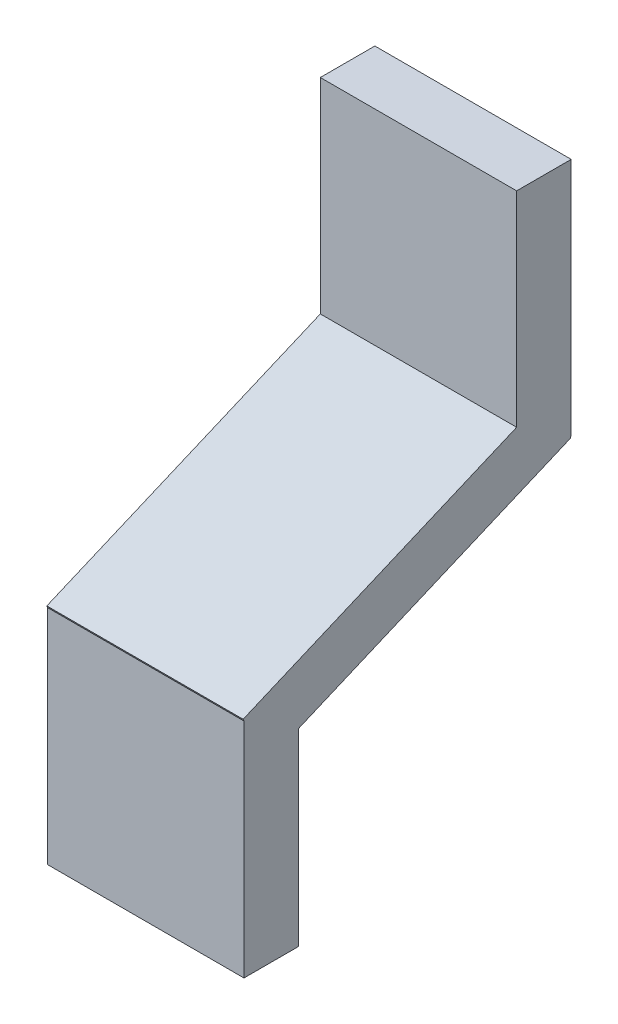
ISO-10303-21;
HEADER;
FILE_DESCRIPTION(('STEP AP214'),'2;1');
FILE_NAME('part.step','',(''),(''),'','','');
FILE_SCHEMA(('AUTOMOTIVE_DESIGN { 1 0 10303 214 1 1 1 1 }'));
ENDSEC;
DATA;
#1=APPLICATION_CONTEXT('core data for automotive mechanical design processes');
#2=APPLICATION_PROTOCOL_DEFINITION('international standard','automotive_design',2000,#1);
#3=PRODUCT_CONTEXT('',#1,'mechanical');
#4=PRODUCT('Part','Part','',(#3));
#5=PRODUCT_RELATED_PRODUCT_CATEGORY('part','',(#4));
#6=PRODUCT_DEFINITION_FORMATION('','',#4);
#7=PRODUCT_DEFINITION_CONTEXT('part definition',#1,'design');
#8=PRODUCT_DEFINITION('design','',#6,#7);
#9=PRODUCT_DEFINITION_SHAPE('','',#8);
#10=(LENGTH_UNIT() NAMED_UNIT(*) SI_UNIT(.MILLI.,.METRE.));
#11=(NAMED_UNIT(*) PLANE_ANGLE_UNIT() SI_UNIT($,.RADIAN.));
#12=(NAMED_UNIT(*) SI_UNIT($,.STERADIAN.) SOLID_ANGLE_UNIT());
#13=UNCERTAINTY_MEASURE_WITH_UNIT(LENGTH_MEASURE(1.E-05),#10,'distance_accuracy_value','');
#14=(GEOMETRIC_REPRESENTATION_CONTEXT(3) GLOBAL_UNCERTAINTY_ASSIGNED_CONTEXT((#13)) GLOBAL_UNIT_ASSIGNED_CONTEXT((#10,
#11,#12)) REPRESENTATION_CONTEXT('',''));
#15=CARTESIAN_POINT('',(0.,0.,0.));
#16=DIRECTION('',(0.,0.,1.));
#17=DIRECTION('',(1.,0.,0.));
#18=AXIS2_PLACEMENT_3D('',#15,#16,#17);
#19=CARTESIAN_POINT('',(6.62,11.,0.5));
#20=DIRECTION('',(0.,0.,1.));
#21=DIRECTION('',(1.,0.,0.));
#22=AXIS2_PLACEMENT_3D('',#19,#20,#21);
#23=PLANE('',#22);
#24=DIRECTION('',(1.,0.,0.));
#25=VECTOR('',#24,1.);
#26=CARTESIAN_POINT('',(6.62,11.3461054439247,0.500000000000314));
#27=LINE('',#26,#25);
#28=CARTESIAN_POINT('',(6.980000014305,11.3461054439242,0.500000000000105));
#29=VERTEX_POINT('',#28);
#30=CARTESIAN_POINT('',(6.62,11.3461054439243,0.500000000000105));
#31=VERTEX_POINT('',#30);
#32=EDGE_CURVE('E148',#29,#31,#27,.F.);
#33=ORIENTED_EDGE('',*,*,#32,.F.);
#34=DIRECTION('',(0.,1.,0.));
#35=VECTOR('',#34,1.);
#36=CARTESIAN_POINT('',(6.980000014305,11.65,0.5));
#37=LINE('',#36,#35);
#38=CARTESIAN_POINT('',(6.980000014305,11.,0.5));
#39=VERTEX_POINT('',#38);
#40=EDGE_CURVE('E154',#39,#29,#37,.T.);
#41=ORIENTED_EDGE('',*,*,#40,.F.);
#42=DIRECTION('',(1.,0.,0.));
#43=VECTOR('',#42,1.);
#44=CARTESIAN_POINT('',(6.62,11.,0.5));
#45=LINE('',#44,#43);
#46=CARTESIAN_POINT('',(6.62,11.,0.5));
#47=VERTEX_POINT('',#46);
#48=EDGE_CURVE('E135',#39,#47,#45,.F.);
#49=ORIENTED_EDGE('',*,*,#48,.T.);
#50=DIRECTION('',(0.,1.,0.));
#51=VECTOR('',#50,1.);
#52=CARTESIAN_POINT('',(6.62,11.65,0.5));
#53=LINE('',#52,#51);
#54=EDGE_CURVE('E182',#47,#31,#53,.T.);
#55=ORIENTED_EDGE('',*,*,#54,.T.);
#56=EDGE_LOOP('',(#33,#41,#49,#55));
#57=FACE_BOUND('',#56,.T.);
#58=ADVANCED_FACE('F17',(#57),#23,.F.);
#59=CARTESIAN_POINT('',(6.62,11.557949520001,0.0009268707435866));
#60=DIRECTION('',(0.,-0.920504786278108,-0.390731286742046));
#61=DIRECTION('',(0.,0.390731286742046,-0.920504786278108));
#62=AXIS2_PLACEMENT_3D('',#59,#60,#61);
#63=PLANE('',#62);
#64=DIRECTION('',(0.,0.39073128674346,-0.920504786277508));
#65=VECTOR('',#64,1.);
#66=CARTESIAN_POINT('',(6.980000014305,11.346105443924,0.5));
#67=LINE('',#66,#65);
#68=CARTESIAN_POINT('',(6.980000014305,11.557949520001,0.000926870743687937));
#69=VERTEX_POINT('',#68);
#70=EDGE_CURVE('E151',#29,#69,#67,.T.);
#71=ORIENTED_EDGE('',*,*,#70,.F.);
#72=ORIENTED_EDGE('',*,*,#32,.T.);
#73=DIRECTION('',(0.,0.39073128674346,-0.920504786277508));
#74=VECTOR('',#73,1.);
#75=CARTESIAN_POINT('',(6.62,11.346105443924,0.5));
#76=LINE('',#75,#74);
#77=CARTESIAN_POINT('',(6.62,11.557949520001,0.000926870743697301));
#78=VERTEX_POINT('',#77);
#79=EDGE_CURVE('E178',#31,#78,#76,.T.);
#80=ORIENTED_EDGE('',*,*,#79,.T.);
#81=DIRECTION('',(1.,0.,0.));
#82=VECTOR('',#81,1.);
#83=CARTESIAN_POINT('',(6.62,11.557949520001,0.00092687074374427));
#84=LINE('',#83,#82);
#85=EDGE_CURVE('E145',#78,#69,#84,.T.);
#86=ORIENTED_EDGE('',*,*,#85,.T.);
#87=EDGE_LOOP('',(#71,#72,#80,#86));
#88=FACE_BOUND('',#87,.T.);
#89=ADVANCED_FACE('F242',(#88),#63,.T.);
#90=CARTESIAN_POINT('',(6.62,11.65,0.04));
#91=DIRECTION('',(0.,-0.390731286742046,0.920504786278108));
#92=DIRECTION('',(0.,-0.920504786278108,-0.390731286742046));
#93=AXIS2_PLACEMENT_3D('',#90,#91,#92);
#94=PLANE('',#93);
#95=DIRECTION('',(0.,0.920504786259214,0.390731286786557));
#96=VECTOR('',#95,1.);
#97=CARTESIAN_POINT('',(6.62,11.557949520001,0.000926870743659899));
#98=LINE('',#97,#96);
#99=CARTESIAN_POINT('',(6.62,11.56,0.001797248280528));
#100=VERTEX_POINT('',#99);
#101=EDGE_CURVE('E123',#78,#100,#98,.T.);
#102=ORIENTED_EDGE('',*,*,#101,.T.);
#103=DIRECTION('',(1.,0.,0.));
#104=VECTOR('',#103,1.);
#105=CARTESIAN_POINT('',(6.62,11.56,0.001797248280528));
#106=LINE('',#105,#104);
#107=CARTESIAN_POINT('',(6.980000014305,11.56,0.001797248280528));
#108=VERTEX_POINT('',#107);
#109=EDGE_CURVE('E97',#100,#108,#106,.T.);
#110=ORIENTED_EDGE('',*,*,#109,.T.);
#111=DIRECTION('',(0.,0.920504786259214,0.390731286786557));
#112=VECTOR('',#111,1.);
#113=CARTESIAN_POINT('',(6.980000014305,11.557949520001,0.000926870743659899));
#114=LINE('',#113,#112);
#115=EDGE_CURVE('E153',#69,#108,#114,.T.);
#116=ORIENTED_EDGE('',*,*,#115,.F.);
#117=ORIENTED_EDGE('',*,*,#85,.F.);
#118=EDGE_LOOP('',(#102,#110,#116,#117));
#119=FACE_BOUND('',#118,.T.);
#120=ADVANCED_FACE('F243',(#119),#94,.F.);
#121=CARTESIAN_POINT('',(6.62,11.56,0.));
#122=DIRECTION('',(0.,1.,0.));
#123=DIRECTION('',(0.,0.,1.));
#124=AXIS2_PLACEMENT_3D('',#121,#122,#123);
#125=PLANE('',#124);
#126=ORIENTED_EDGE('',*,*,#109,.F.);
#127=DIRECTION('',(0.,0.,1.));
#128=VECTOR('',#127,1.);
#129=CARTESIAN_POINT('',(6.62,11.56,0.));
#130=LINE('',#129,#128);
#131=CARTESIAN_POINT('',(6.62,11.56,0.));
#132=VERTEX_POINT('',#131);
#133=EDGE_CURVE('E20',#100,#132,#130,.F.);
#134=ORIENTED_EDGE('',*,*,#133,.T.);
#135=DIRECTION('',(1.,0.,0.));
#136=VECTOR('',#135,1.);
#137=CARTESIAN_POINT('',(6.62,11.56,0.));
#138=LINE('',#137,#136);
#139=CARTESIAN_POINT('',(6.980000014305,11.56,0.));
#140=VERTEX_POINT('',#139);
#141=EDGE_CURVE('E104',#132,#140,#138,.T.);
#142=ORIENTED_EDGE('',*,*,#141,.T.);
#143=DIRECTION('',(0.,0.,-1.));
#144=VECTOR('',#143,1.);
#145=CARTESIAN_POINT('',(6.980000014305,11.56,0.04));
#146=LINE('',#145,#144);
#147=EDGE_CURVE('E194',#108,#140,#146,.T.);
#148=ORIENTED_EDGE('',*,*,#147,.F.);
#149=EDGE_LOOP('',(#126,#134,#142,#148));
#150=FACE_BOUND('',#149,.T.);
#151=ADVANCED_FACE('F122',(#150),#125,.F.);
#152=CARTESIAN_POINT('',(6.62,11.56,0.));
#153=DIRECTION('',(0.,0.,1.));
#154=DIRECTION('',(1.,0.,0.));
#155=AXIS2_PLACEMENT_3D('',#152,#153,#154);
#156=PLANE('',#155);
#157=ORIENTED_EDGE('',*,*,#141,.F.);
#158=DIRECTION('',(0.,1.,0.));
#159=VECTOR('',#158,1.);
#160=CARTESIAN_POINT('',(6.62,11.65,0.));
#161=LINE('',#160,#159);
#162=CARTESIAN_POINT('',(6.62,11.999999997616,0.));
#163=VERTEX_POINT('',#162);
#164=EDGE_CURVE('E108',#132,#163,#161,.T.);
#165=ORIENTED_EDGE('',*,*,#164,.T.);
#166=DIRECTION('',(1.,0.,0.));
#167=VECTOR('',#166,1.);
#168=CARTESIAN_POINT('',(6.62,11.999999997616,0.));
#169=LINE('',#168,#167);
#170=CARTESIAN_POINT('',(6.980000014305,11.999999997616,0.));
#171=VERTEX_POINT('',#170);
#172=EDGE_CURVE('E110',#171,#163,#169,.F.);
#173=ORIENTED_EDGE('',*,*,#172,.F.);
#174=DIRECTION('',(0.,1.,0.));
#175=VECTOR('',#174,1.);
#176=CARTESIAN_POINT('',(6.980000014305,11.65,0.));
#177=LINE('',#176,#175);
#178=EDGE_CURVE('E109',#140,#171,#177,.T.);
#179=ORIENTED_EDGE('',*,*,#178,.F.);
#180=EDGE_LOOP('',(#157,#165,#173,#179));
#181=FACE_BOUND('',#180,.T.);
#182=ADVANCED_FACE('F106',(#181),#156,.F.);
#183=CARTESIAN_POINT('',(6.62,11.999999997616,0.));
#184=DIRECTION('',(0.,1.,0.));
#185=DIRECTION('',(0.,0.,1.));
#186=AXIS2_PLACEMENT_3D('',#183,#184,#185);
#187=PLANE('',#186);
#188=ORIENTED_EDGE('',*,*,#172,.T.);
#189=DIRECTION('',(0.,0.,-1.));
#190=VECTOR('',#189,1.);
#191=CARTESIAN_POINT('',(6.62,11.999999997616,0.04));
#192=LINE('',#191,#190);
#193=CARTESIAN_POINT('',(6.62,11.999999997616,0.10000000149));
#194=VERTEX_POINT('',#193);
#195=EDGE_CURVE('E120',#163,#194,#192,.F.);
#196=ORIENTED_EDGE('',*,*,#195,.T.);
#197=DIRECTION('',(1.,0.,0.));
#198=VECTOR('',#197,1.);
#199=CARTESIAN_POINT('',(6.62,11.999999997616,0.10000000149));
#200=LINE('',#199,#198);
#201=CARTESIAN_POINT('',(6.980000014305,11.999999997616,0.10000000149));
#202=VERTEX_POINT('',#201);
#203=EDGE_CURVE('E181',#202,#194,#200,.F.);
#204=ORIENTED_EDGE('',*,*,#203,.F.);
#205=DIRECTION('',(0.,0.,-1.));
#206=VECTOR('',#205,1.);
#207=CARTESIAN_POINT('',(6.980000014305,11.999999997616,0.04));
#208=LINE('',#207,#206);
#209=EDGE_CURVE('E140',#171,#202,#208,.F.);
#210=ORIENTED_EDGE('',*,*,#209,.F.);
#211=EDGE_LOOP('',(#188,#196,#204,#210));
#212=FACE_BOUND('',#211,.T.);
#213=ADVANCED_FACE('F271',(#212),#187,.T.);
#214=CARTESIAN_POINT('',(6.62,11.,0.60000000149));
#215=DIRECTION('',(0.,0.,1.));
#216=DIRECTION('',(1.,0.,0.));
#217=AXIS2_PLACEMENT_3D('',#214,#215,#216);
#218=PLANE('',#217);
#219=DIRECTION('',(0.,1.,0.));
#220=VECTOR('',#219,1.);
#221=CARTESIAN_POINT('',(6.980000014305,11.65,0.60000000149));
#222=LINE('',#221,#220);
#223=CARTESIAN_POINT('',(6.980000014305,11.408101447657,0.600000001490072));
#224=VERTEX_POINT('',#223);
#225=CARTESIAN_POINT('',(6.980000014305,11.,0.60000000149));
#226=VERTEX_POINT('',#225);
#227=EDGE_CURVE('E168',#224,#226,#222,.F.);
#228=ORIENTED_EDGE('',*,*,#227,.F.);
#229=DIRECTION('',(1.,0.,0.));
#230=VECTOR('',#229,1.);
#231=CARTESIAN_POINT('',(6.62,11.4081014476569,0.600000001490144));
#232=LINE('',#231,#230);
#233=CARTESIAN_POINT('',(6.62,11.408101447657,0.600000001490072));
#234=VERTEX_POINT('',#233);
#235=EDGE_CURVE('E124',#234,#224,#232,.T.);
#236=ORIENTED_EDGE('',*,*,#235,.F.);
#237=DIRECTION('',(0.,1.,0.));
#238=VECTOR('',#237,1.);
#239=CARTESIAN_POINT('',(6.62,11.65,0.60000000149));
#240=LINE('',#239,#238);
#241=CARTESIAN_POINT('',(6.62,11.,0.60000000149));
#242=VERTEX_POINT('',#241);
#243=EDGE_CURVE('E192',#234,#242,#240,.F.);
#244=ORIENTED_EDGE('',*,*,#243,.T.);
#245=DIRECTION('',(1.,0.,0.));
#246=VECTOR('',#245,1.);
#247=CARTESIAN_POINT('',(6.62,11.,0.60000000149));
#248=LINE('',#247,#246);
#249=EDGE_CURVE('E127',#242,#226,#248,.T.);
#250=ORIENTED_EDGE('',*,*,#249,.T.);
#251=EDGE_LOOP('',(#228,#236,#244,#250));
#252=FACE_BOUND('',#251,.T.);
#253=ADVANCED_FACE('F232',(#252),#218,.T.);
#254=CARTESIAN_POINT('',(6.62,11.,0.5));
#255=DIRECTION('',(0.,1.,0.));
#256=DIRECTION('',(0.,0.,1.));
#257=AXIS2_PLACEMENT_3D('',#254,#255,#256);
#258=PLANE('',#257);
#259=DIRECTION('',(0.,0.,-1.));
#260=VECTOR('',#259,1.);
#261=CARTESIAN_POINT('',(6.62,11.,0.04));
#262=LINE('',#261,#260);
#263=EDGE_CURVE('E187',#242,#47,#262,.T.);
#264=ORIENTED_EDGE('',*,*,#263,.T.);
#265=ORIENTED_EDGE('',*,*,#48,.F.);
#266=DIRECTION('',(0.,0.,-1.));
#267=VECTOR('',#266,1.);
#268=CARTESIAN_POINT('',(6.980000014305,11.,0.04));
#269=LINE('',#268,#267);
#270=EDGE_CURVE('E164',#226,#39,#269,.T.);
#271=ORIENTED_EDGE('',*,*,#270,.F.);
#272=ORIENTED_EDGE('',*,*,#249,.F.);
#273=EDGE_LOOP('',(#264,#265,#271,#272));
#274=FACE_BOUND('',#273,.T.);
#275=ADVANCED_FACE('F235',(#274),#258,.F.);
#276=CARTESIAN_POINT('',(6.62,11.411653909498,0.601507932798));
#277=DIRECTION('',(0.,-0.390731286742046,0.920504786278108));
#278=DIRECTION('',(0.,-0.920504786278108,-0.390731286742046));
#279=AXIS2_PLACEMENT_3D('',#276,#277,#278);
#280=PLANE('',#279);
#281=ORIENTED_EDGE('',*,*,#235,.T.);
#282=DIRECTION('',(0.,-0.920504786262243,-0.390731286779422));
#283=VECTOR('',#282,1.);
#284=CARTESIAN_POINT('',(6.980000014305,11.411653909498,0.601507932798));
#285=LINE('',#284,#283);
#286=CARTESIAN_POINT('',(6.980000014305,11.4116539094979,0.601507932797974));
#287=VERTEX_POINT('',#286);
#288=EDGE_CURVE('E227',#287,#224,#285,.T.);
#289=ORIENTED_EDGE('',*,*,#288,.F.);
#290=DIRECTION('',(1.,0.,0.));
#291=VECTOR('',#290,1.);
#292=CARTESIAN_POINT('',(6.62,11.4116539094978,0.601507932797897));
#293=LINE('',#292,#291);
#294=CARTESIAN_POINT('',(6.62,11.4116539094979,0.601507932797974));
#295=VERTEX_POINT('',#294);
#296=EDGE_CURVE('E167',#287,#295,#293,.F.);
#297=ORIENTED_EDGE('',*,*,#296,.T.);
#298=DIRECTION('',(0.,-0.920504786262243,-0.390731286779422));
#299=VECTOR('',#298,1.);
#300=CARTESIAN_POINT('',(6.62,11.411653909498,0.601507932798));
#301=LINE('',#300,#299);
#302=EDGE_CURVE('E175',#295,#234,#301,.T.);
#303=ORIENTED_EDGE('',*,*,#302,.T.);
#304=EDGE_LOOP('',(#281,#289,#297,#303));
#305=FACE_BOUND('',#304,.T.);
#306=ADVANCED_FACE('F210',(#305),#280,.T.);
#307=CARTESIAN_POINT('',(6.62,11.65,0.04));
#308=DIRECTION('',(1.,0.,0.));
#309=DIRECTION('',(0.,0.,-1.));
#310=AXIS2_PLACEMENT_3D('',#307,#308,#309);
#311=PLANE('',#310);
#312=ORIENTED_EDGE('',*,*,#54,.F.);
#313=ORIENTED_EDGE('',*,*,#263,.F.);
#314=ORIENTED_EDGE('',*,*,#243,.F.);
#315=ORIENTED_EDGE('',*,*,#302,.F.);
#316=DIRECTION('',(0.,0.390731286742046,-0.920504786278108));
#317=VECTOR('',#316,1.);
#318=CARTESIAN_POINT('',(6.62,11.65,0.04));
#319=LINE('',#318,#317);
#320=CARTESIAN_POINT('',(6.62,11.624531498221,0.100000001490019));
#321=VERTEX_POINT('',#320);
#322=EDGE_CURVE('E216',#295,#321,#319,.T.);
#323=ORIENTED_EDGE('',*,*,#322,.T.);
#324=DIRECTION('',(0.,1.,0.));
#325=VECTOR('',#324,1.);
#326=CARTESIAN_POINT('',(6.62,11.56,0.10000000149));
#327=LINE('',#326,#325);
#328=EDGE_CURVE('E161',#194,#321,#327,.F.);
#329=ORIENTED_EDGE('',*,*,#328,.F.);
#330=ORIENTED_EDGE('',*,*,#195,.F.);
#331=ORIENTED_EDGE('',*,*,#164,.F.);
#332=ORIENTED_EDGE('',*,*,#133,.F.);
#333=ORIENTED_EDGE('',*,*,#101,.F.);
#334=ORIENTED_EDGE('',*,*,#79,.F.);
#335=EDGE_LOOP('',(#312,#313,#314,#315,#323,#329,#330,#331,#332,#333,#334));
#336=FACE_BOUND('',#335,.T.);
#337=ADVANCED_FACE('F115',(#336),#311,.F.);
#338=CARTESIAN_POINT('',(6.62,11.56,0.10000000149));
#339=DIRECTION('',(0.,0.,1.));
#340=DIRECTION('',(1.,0.,0.));
#341=AXIS2_PLACEMENT_3D('',#338,#339,#340);
#342=PLANE('',#341);
#343=ORIENTED_EDGE('',*,*,#328,.T.);
#344=DIRECTION('',(1.,0.,0.));
#345=VECTOR('',#344,1.);
#346=CARTESIAN_POINT('',(6.62,11.6245314982212,0.100000001490075));
#347=LINE('',#346,#345);
#348=CARTESIAN_POINT('',(6.980000014305,11.624531498221,0.100000001490019));
#349=VERTEX_POINT('',#348);
#350=EDGE_CURVE('E26',#321,#349,#347,.T.);
#351=ORIENTED_EDGE('',*,*,#350,.T.);
#352=DIRECTION('',(0.,1.,0.));
#353=VECTOR('',#352,1.);
#354=CARTESIAN_POINT('',(6.980000014305,11.65,0.10000000149));
#355=LINE('',#354,#353);
#356=EDGE_CURVE('E34',#202,#349,#355,.F.);
#357=ORIENTED_EDGE('',*,*,#356,.F.);
#358=ORIENTED_EDGE('',*,*,#203,.T.);
#359=EDGE_LOOP('',(#343,#351,#357,#358));
#360=FACE_BOUND('',#359,.T.);
#361=ADVANCED_FACE('F257',(#360),#342,.T.);
#362=CARTESIAN_POINT('',(6.980000014305,11.65,0.04));
#363=DIRECTION('',(1.,0.,0.));
#364=DIRECTION('',(0.,0.,-1.));
#365=AXIS2_PLACEMENT_3D('',#362,#363,#364);
#366=PLANE('',#365);
#367=ORIENTED_EDGE('',*,*,#227,.T.);
#368=ORIENTED_EDGE('',*,*,#270,.T.);
#369=ORIENTED_EDGE('',*,*,#40,.T.);
#370=ORIENTED_EDGE('',*,*,#70,.T.);
#371=ORIENTED_EDGE('',*,*,#115,.T.);
#372=ORIENTED_EDGE('',*,*,#147,.T.);
#373=ORIENTED_EDGE('',*,*,#178,.T.);
#374=ORIENTED_EDGE('',*,*,#209,.T.);
#375=ORIENTED_EDGE('',*,*,#356,.T.);
#376=DIRECTION('',(0.,0.390731286742046,-0.920504786278108));
#377=VECTOR('',#376,1.);
#378=CARTESIAN_POINT('',(6.980000014305,11.65,0.04));
#379=LINE('',#378,#377);
#380=EDGE_CURVE('E11',#349,#287,#379,.F.);
#381=ORIENTED_EDGE('',*,*,#380,.T.);
#382=ORIENTED_EDGE('',*,*,#288,.T.);
#383=EDGE_LOOP('',(#367,#368,#369,#370,#371,#372,#373,#374,#375,#381,#382));
#384=FACE_BOUND('',#383,.T.);
#385=ADVANCED_FACE('F230',(#384),#366,.T.);
#386=CARTESIAN_POINT('',(6.62,11.65,0.04));
#387=DIRECTION('',(0.,-0.920504786278108,-0.390731286742046));
#388=DIRECTION('',(0.,0.390731286742046,-0.920504786278108));
#389=AXIS2_PLACEMENT_3D('',#386,#387,#388);
#390=PLANE('',#389);
#391=ORIENTED_EDGE('',*,*,#350,.F.);
#392=ORIENTED_EDGE('',*,*,#322,.F.);
#393=ORIENTED_EDGE('',*,*,#296,.F.);
#394=ORIENTED_EDGE('',*,*,#380,.F.);
#395=EDGE_LOOP('',(#391,#392,#393,#394));
#396=FACE_BOUND('',#395,.T.);
#397=ADVANCED_FACE('F220',(#396),#390,.F.);
#398=CLOSED_SHELL('',(#58,#89,#120,#151,#182,#213,#253,#275,#306,#337,#361,#385,#397));
#399=MANIFOLD_SOLID_BREP('B1',#398);
#400=ADVANCED_BREP_SHAPE_REPRESENTATION('',(#18,#399),#14);
#401=SHAPE_DEFINITION_REPRESENTATION(#9,#400);
ENDSEC;
END-ISO-10303-21;
